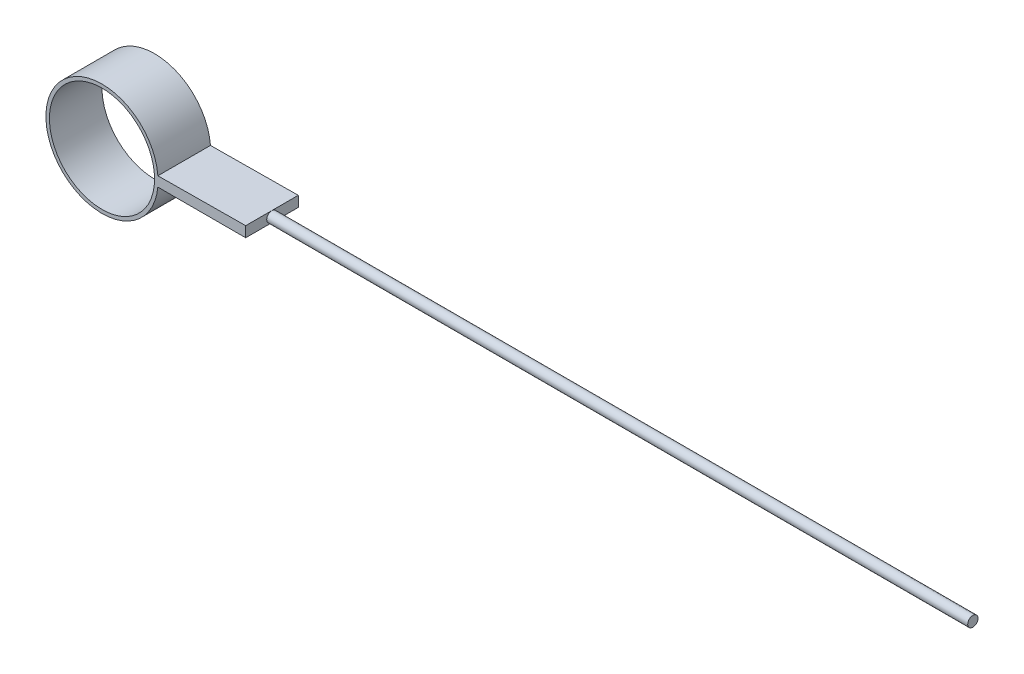
ISO-10303-21;
HEADER;
FILE_DESCRIPTION(('STEP AP214'),'2;1');
FILE_NAME('part.step','',(''),(''),'','','');
FILE_SCHEMA(('AUTOMOTIVE_DESIGN { 1 0 10303 214 1 1 1 1 }'));
ENDSEC;
DATA;
#1=APPLICATION_CONTEXT('core data for automotive mechanical design processes');
#2=APPLICATION_PROTOCOL_DEFINITION('international standard','automotive_design',2000,#1);
#3=PRODUCT_CONTEXT('',#1,'mechanical');
#4=PRODUCT('Part','Part','',(#3));
#5=PRODUCT_RELATED_PRODUCT_CATEGORY('part','',(#4));
#6=PRODUCT_DEFINITION_FORMATION('','',#4);
#7=PRODUCT_DEFINITION_CONTEXT('part definition',#1,'design');
#8=PRODUCT_DEFINITION('design','',#6,#7);
#9=PRODUCT_DEFINITION_SHAPE('','',#8);
#10=(LENGTH_UNIT() NAMED_UNIT(*) SI_UNIT(.MILLI.,.METRE.));
#11=(NAMED_UNIT(*) PLANE_ANGLE_UNIT() SI_UNIT($,.RADIAN.));
#12=(NAMED_UNIT(*) SI_UNIT($,.STERADIAN.) SOLID_ANGLE_UNIT());
#13=UNCERTAINTY_MEASURE_WITH_UNIT(LENGTH_MEASURE(1.E-05),#10,'distance_accuracy_value','');
#14=(GEOMETRIC_REPRESENTATION_CONTEXT(3) GLOBAL_UNCERTAINTY_ASSIGNED_CONTEXT((#13)) GLOBAL_UNIT_ASSIGNED_CONTEXT((#10,
#11,#12)) REPRESENTATION_CONTEXT('',''));
#15=CARTESIAN_POINT('',(0.,0.,0.));
#16=DIRECTION('',(0.,0.,1.));
#17=DIRECTION('',(1.,0.,0.));
#18=AXIS2_PLACEMENT_3D('',#15,#16,#17);
#19=CARTESIAN_POINT('',(-28.4076870646138,0.820956977687111,6.74475647873758));
#20=DIRECTION('',(0.00822632859094543,-0.999966163186492,0.));
#21=DIRECTION('',(0.999966163186492,0.00822632859094544,0.));
#22=AXIS2_PLACEMENT_3D('',#19,#20,#21);
#23=PLANE('',#22);
#24=DIRECTION('',(-0.999966163186492,-0.00822632859094544,0.));
#25=VECTOR('',#24,1.);
#26=CARTESIAN_POINT('',(-28.4076870646138,0.820956977687111,-3.75524352126242));
#27=LINE('',#26,#25);
#28=CARTESIAN_POINT('',(0.299008087900475,1.05711567562961,-3.75524352126242));
#29=VERTEX_POINT('',#28);
#30=CARTESIAN_POINT('',(-17.237674822055,0.912848278068077,-3.75524352126242));
#31=VERTEX_POINT('',#30);
#32=EDGE_CURVE('E110',#29,#31,#27,.T.);
#33=ORIENTED_EDGE('',*,*,#32,.T.);
#34=DIRECTION('',(0.,0.,-1.));
#35=VECTOR('',#34,1.);
#36=CARTESIAN_POINT('',(-17.237674822055,0.912848278068077,6.74475647873758));
#37=LINE('',#36,#35);
#38=CARTESIAN_POINT('',(-17.237674822055,0.912848278068077,6.74475647873758));
#39=VERTEX_POINT('',#38);
#40=EDGE_CURVE('E44',#39,#31,#37,.T.);
#41=ORIENTED_EDGE('',*,*,#40,.F.);
#42=DIRECTION('',(-0.999966163186492,-0.00822632859094544,0.));
#43=VECTOR('',#42,1.);
#44=CARTESIAN_POINT('',(-28.4076870646138,0.820956977687111,6.74475647873758));
#45=LINE('',#44,#43);
#46=CARTESIAN_POINT('',(0.299008087900475,1.05711567562961,6.74475647873758));
#47=VERTEX_POINT('',#46);
#48=EDGE_CURVE('E91',#47,#39,#45,.T.);
#49=ORIENTED_EDGE('',*,*,#48,.F.);
#50=DIRECTION('',(0.,0.,-1.));
#51=VECTOR('',#50,1.);
#52=CARTESIAN_POINT('',(0.299008087900475,1.05711567562961,6.74475647873758));
#53=LINE('',#52,#51);
#54=EDGE_CURVE('E109',#47,#29,#53,.T.);
#55=ORIENTED_EDGE('',*,*,#54,.T.);
#56=EDGE_LOOP('',(#33,#41,#49,#55));
#57=FACE_BOUND('',#56,.T.);
#58=ADVANCED_FACE('F41',(#57),#23,.F.);
#59=CARTESIAN_POINT('',(-28.4009919120995,0.00711567562961437,6.74475647873758));
#60=DIRECTION('',(0.,0.,-1.));
#61=DIRECTION('',(-1.,0.,0.));
#62=AXIS2_PLACEMENT_3D('',#59,#60,#61);
#63=CYLINDRICAL_SURFACE('',#62,11.2);
#64=CARTESIAN_POINT('',(-28.4009919120995,0.00711567562961437,-3.75524352126242));
#65=DIRECTION('',(0.,0.,1.));
#66=DIRECTION('',(1.,0.,0.));
#67=AXIS2_PLACEMENT_3D('',#64,#65,#66);
#68=CIRCLE('',#67,11.2);
#69=CARTESIAN_POINT('',(-17.2503192866477,-1.04288432437039,-3.75524352126242));
#70=VERTEX_POINT('',#69);
#71=EDGE_CURVE('E97',#31,#70,#68,.T.);
#72=ORIENTED_EDGE('',*,*,#71,.T.);
#73=DIRECTION('',(0.,0.,-1.));
#74=VECTOR('',#73,1.);
#75=CARTESIAN_POINT('',(-17.2503192866477,-1.04288432437039,6.74475647873758));
#76=LINE('',#75,#74);
#77=CARTESIAN_POINT('',(-17.2503192866477,-1.04288432437039,6.74475647873758));
#78=VERTEX_POINT('',#77);
#79=EDGE_CURVE('E95',#78,#70,#76,.T.);
#80=ORIENTED_EDGE('',*,*,#79,.F.);
#81=CARTESIAN_POINT('',(-28.4009919120995,0.00711567562961437,6.74475647873758));
#82=DIRECTION('',(0.,0.,1.));
#83=DIRECTION('',(1.,0.,0.));
#84=AXIS2_PLACEMENT_3D('',#81,#82,#83);
#85=CIRCLE('',#84,11.2);
#86=EDGE_CURVE('E85',#39,#78,#85,.T.);
#87=ORIENTED_EDGE('',*,*,#86,.F.);
#88=ORIENTED_EDGE('',*,*,#40,.T.);
#89=EDGE_LOOP('',(#72,#80,#87,#88));
#90=FACE_BOUND('',#89,.T.);
#91=ADVANCED_FACE('F96',(#90),#63,.T.);
#92=CARTESIAN_POINT('',(-28.4009919120995,-1.04288432437039,6.74475647873758));
#93=DIRECTION('',(0.,-1.,0.));
#94=DIRECTION('',(0.,0.,-1.));
#95=AXIS2_PLACEMENT_3D('',#92,#93,#94);
#96=PLANE('',#95);
#97=DIRECTION('',(-1.,0.,0.));
#98=VECTOR('',#97,1.);
#99=CARTESIAN_POINT('',(-28.4009919120995,-1.04288432437039,-3.75524352126242));
#100=LINE('',#99,#98);
#101=CARTESIAN_POINT('',(0.299008087900475,-1.04288432437039,-3.75524352126242));
#102=VERTEX_POINT('',#101);
#103=EDGE_CURVE('E115',#102,#70,#100,.T.);
#104=ORIENTED_EDGE('',*,*,#103,.F.);
#105=DIRECTION('',(0.,0.,-1.));
#106=VECTOR('',#105,1.);
#107=CARTESIAN_POINT('',(0.299008087900475,-1.04288432437039,6.74475647873758));
#108=LINE('',#107,#106);
#109=CARTESIAN_POINT('',(0.299008087900475,-1.04288432437039,6.74475647873758));
#110=VERTEX_POINT('',#109);
#111=EDGE_CURVE('E74',#110,#102,#108,.T.);
#112=ORIENTED_EDGE('',*,*,#111,.F.);
#113=DIRECTION('',(-1.,0.,0.));
#114=VECTOR('',#113,1.);
#115=CARTESIAN_POINT('',(-28.4009919120995,-1.04288432437039,6.74475647873758));
#116=LINE('',#115,#114);
#117=EDGE_CURVE('E89',#110,#78,#116,.T.);
#118=ORIENTED_EDGE('',*,*,#117,.T.);
#119=ORIENTED_EDGE('',*,*,#79,.T.);
#120=EDGE_LOOP('',(#104,#112,#118,#119));
#121=FACE_BOUND('',#120,.T.);
#122=ADVANCED_FACE('F101',(#121),#96,.T.);
#123=CARTESIAN_POINT('',(0.299008087900475,0.00711567562961437,6.74475647873758));
#124=DIRECTION('',(-1.,0.,0.));
#125=DIRECTION('',(0.,0.,1.));
#126=AXIS2_PLACEMENT_3D('',#123,#124,#125);
#127=PLANE('',#126);
#128=CARTESIAN_POINT('',(0.299008087900475,0.00711567562961437,1.51596152770785));
#129=DIRECTION('',(1.,0.,0.));
#130=DIRECTION('',(0.,0.,-1.));
#131=AXIS2_PLACEMENT_3D('',#128,#129,#130);
#132=CIRCLE('',#131,1.02576907031325);
#133=CARTESIAN_POINT('',(0.299008087900475,0.00711567562961437,0.490192457394599));
#134=VERTEX_POINT('',#133);
#135=EDGE_CURVE('E11',#134,#134,#132,.T.);
#136=ORIENTED_EDGE('',*,*,#135,.F.);
#137=EDGE_LOOP('',(#136));
#138=FACE_BOUND('',#137,.T.);
#139=DIRECTION('',(0.,1.,0.));
#140=VECTOR('',#139,1.);
#141=CARTESIAN_POINT('',(0.299008087900475,0.00711567562961437,-3.75524352126242));
#142=LINE('',#141,#140);
#143=EDGE_CURVE('E77',#102,#29,#142,.T.);
#144=ORIENTED_EDGE('',*,*,#143,.T.);
#145=ORIENTED_EDGE('',*,*,#54,.F.);
#146=DIRECTION('',(0.,1.,0.));
#147=VECTOR('',#146,1.);
#148=CARTESIAN_POINT('',(0.299008087900475,0.00711567562961437,6.74475647873758));
#149=LINE('',#148,#147);
#150=EDGE_CURVE('E58',#110,#47,#149,.T.);
#151=ORIENTED_EDGE('',*,*,#150,.F.);
#152=ORIENTED_EDGE('',*,*,#111,.T.);
#153=EDGE_LOOP('',(#144,#145,#151,#152));
#154=FACE_BOUND('',#153,.T.);
#155=ADVANCED_FACE('F134',(#138,#154),#127,.F.);
#156=CARTESIAN_POINT('',(-28.4009919120995,0.00711567562961437,6.74475647873758));
#157=DIRECTION('',(0.,0.,-1.));
#158=DIRECTION('',(-1.,0.,0.));
#159=AXIS2_PLACEMENT_3D('',#156,#157,#158);
#160=CYLINDRICAL_SURFACE('',#159,10.5);
#161=CARTESIAN_POINT('',(-28.4009919120995,0.00711567562961437,6.74475647873758));
#162=DIRECTION('',(0.,0.,1.));
#163=DIRECTION('',(1.,0.,0.));
#164=AXIS2_PLACEMENT_3D('',#161,#162,#163);
#165=CIRCLE('',#164,10.5);
#166=CARTESIAN_POINT('',(-17.9009919120995,0.00711567562961437,6.74475647873758));
#167=VERTEX_POINT('',#166);
#168=EDGE_CURVE('E103',#167,#167,#165,.T.);
#169=ORIENTED_EDGE('',*,*,#168,.T.);
#170=EDGE_LOOP('',(#169));
#171=FACE_BOUND('',#170,.T.);
#172=CARTESIAN_POINT('',(-28.4009919120995,0.00711567562961437,-3.75524352126242));
#173=DIRECTION('',(0.,0.,1.));
#174=DIRECTION('',(1.,0.,0.));
#175=AXIS2_PLACEMENT_3D('',#172,#173,#174);
#176=CIRCLE('',#175,10.5);
#177=CARTESIAN_POINT('',(-17.9009919120995,0.00711567562961437,-3.75524352126242));
#178=VERTEX_POINT('',#177);
#179=EDGE_CURVE('E118',#178,#178,#176,.T.);
#180=ORIENTED_EDGE('',*,*,#179,.F.);
#181=EDGE_LOOP('',(#180));
#182=FACE_BOUND('',#181,.T.);
#183=ADVANCED_FACE('F132',(#171,#182),#160,.F.);
#184=CARTESIAN_POINT('',(-28.4009919120995,0.00711567562961437,6.74475647873758));
#185=DIRECTION('',(0.,0.,1.));
#186=DIRECTION('',(1.,0.,0.));
#187=AXIS2_PLACEMENT_3D('',#184,#185,#186);
#188=PLANE('',#187);
#189=ORIENTED_EDGE('',*,*,#48,.T.);
#190=ORIENTED_EDGE('',*,*,#86,.T.);
#191=ORIENTED_EDGE('',*,*,#117,.F.);
#192=ORIENTED_EDGE('',*,*,#150,.T.);
#193=EDGE_LOOP('',(#189,#190,#191,#192));
#194=FACE_BOUND('',#193,.T.);
#195=ORIENTED_EDGE('',*,*,#168,.F.);
#196=EDGE_LOOP('',(#195));
#197=FACE_BOUND('',#196,.T.);
#198=ADVANCED_FACE('F86',(#194,#197),#188,.T.);
#199=CARTESIAN_POINT('',(-28.4009919120995,0.00711567562961437,-3.75524352126242));
#200=DIRECTION('',(0.,0.,1.));
#201=DIRECTION('',(1.,0.,0.));
#202=AXIS2_PLACEMENT_3D('',#199,#200,#201);
#203=PLANE('',#202);
#204=ORIENTED_EDGE('',*,*,#32,.F.);
#205=ORIENTED_EDGE('',*,*,#143,.F.);
#206=ORIENTED_EDGE('',*,*,#103,.T.);
#207=ORIENTED_EDGE('',*,*,#71,.F.);
#208=EDGE_LOOP('',(#204,#205,#206,#207));
#209=FACE_BOUND('',#208,.T.);
#210=ORIENTED_EDGE('',*,*,#179,.T.);
#211=EDGE_LOOP('',(#210));
#212=FACE_BOUND('',#211,.T.);
#213=ADVANCED_FACE('F125',(#209,#212),#203,.F.);
#214=CARTESIAN_POINT('',(140.2990080879,0.00711567562961437,1.51596152770785));
#215=DIRECTION('',(-1.,0.,0.));
#216=DIRECTION('',(0.,0.,1.));
#217=AXIS2_PLACEMENT_3D('',#214,#215,#216);
#218=CYLINDRICAL_SURFACE('',#217,1.02576907031325);
#219=CARTESIAN_POINT('',(140.2990080879,0.00711567562961437,1.51596152770785));
#220=DIRECTION('',(1.,0.,0.));
#221=DIRECTION('',(0.,0.,-1.));
#222=AXIS2_PLACEMENT_3D('',#219,#220,#221);
#223=CIRCLE('',#222,1.02576907031325);
#224=CARTESIAN_POINT('',(140.2990080879,0.00711567562961437,0.490192457394599));
#225=VERTEX_POINT('',#224);
#226=EDGE_CURVE('E113',#225,#225,#223,.T.);
#227=ORIENTED_EDGE('',*,*,#226,.F.);
#228=EDGE_LOOP('',(#227));
#229=FACE_BOUND('',#228,.T.);
#230=ORIENTED_EDGE('',*,*,#135,.T.);
#231=EDGE_LOOP('',(#230));
#232=FACE_BOUND('',#231,.T.);
#233=ADVANCED_FACE('F128',(#229,#232),#218,.T.);
#234=CARTESIAN_POINT('',(140.2990080879,0.00711567562961437,1.51596152770785));
#235=DIRECTION('',(1.,0.,0.));
#236=DIRECTION('',(0.,0.,-1.));
#237=AXIS2_PLACEMENT_3D('',#234,#235,#236);
#238=PLANE('',#237);
#239=ORIENTED_EDGE('',*,*,#226,.T.);
#240=EDGE_LOOP('',(#239));
#241=FACE_BOUND('',#240,.T.);
#242=ADVANCED_FACE('F189',(#241),#238,.T.);
#243=CLOSED_SHELL('',(#58,#91,#122,#155,#183,#198,#213,#233,#242));
#244=MANIFOLD_SOLID_BREP('B2',#243);
#245=ADVANCED_BREP_SHAPE_REPRESENTATION('',(#18,#244),#14);
#246=SHAPE_DEFINITION_REPRESENTATION(#9,#245);
ENDSEC;
END-ISO-10303-21;
